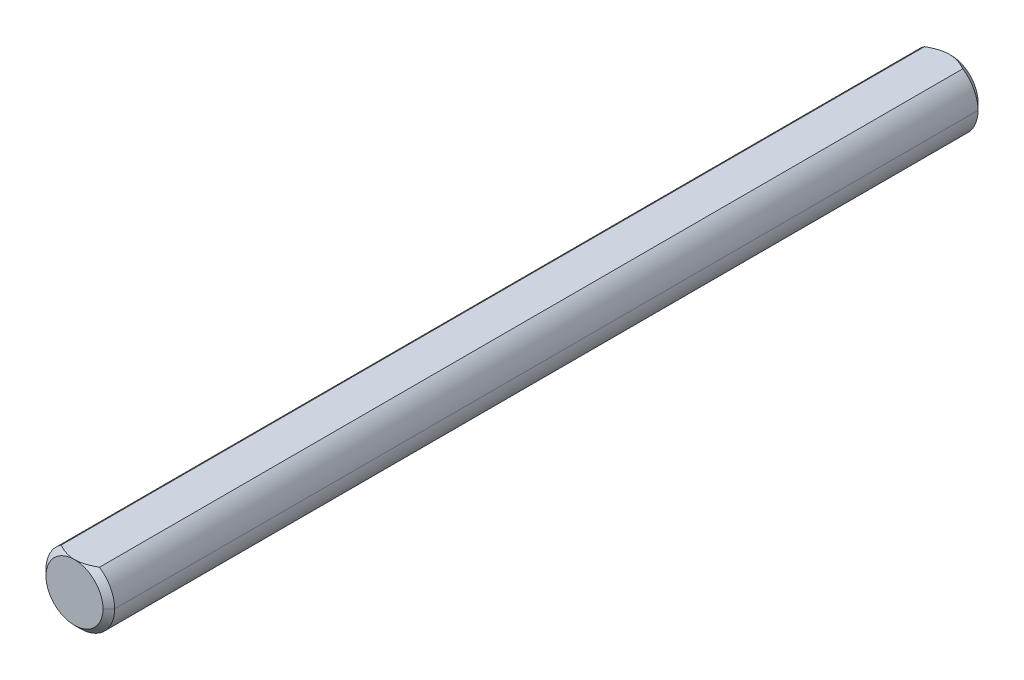
ISO-10303-21;
HEADER;
FILE_DESCRIPTION(('STEP AP214'),'2;1');
FILE_NAME('part.step','',(''),(''),'','','');
FILE_SCHEMA(('AUTOMOTIVE_DESIGN { 1 0 10303 214 1 1 1 1 }'));
ENDSEC;
DATA;
#1=APPLICATION_CONTEXT('core data for automotive mechanical design processes');
#2=APPLICATION_PROTOCOL_DEFINITION('international standard','automotive_design',2000,#1);
#3=PRODUCT_CONTEXT('',#1,'mechanical');
#4=PRODUCT('Part','Part','',(#3));
#5=PRODUCT_RELATED_PRODUCT_CATEGORY('part','',(#4));
#6=PRODUCT_DEFINITION_FORMATION('','',#4);
#7=PRODUCT_DEFINITION_CONTEXT('part definition',#1,'design');
#8=PRODUCT_DEFINITION('design','',#6,#7);
#9=PRODUCT_DEFINITION_SHAPE('','',#8);
#10=(LENGTH_UNIT() NAMED_UNIT(*) SI_UNIT(.MILLI.,.METRE.));
#11=(NAMED_UNIT(*) PLANE_ANGLE_UNIT() SI_UNIT($,.RADIAN.));
#12=(NAMED_UNIT(*) SI_UNIT($,.STERADIAN.) SOLID_ANGLE_UNIT());
#13=UNCERTAINTY_MEASURE_WITH_UNIT(LENGTH_MEASURE(1.E-05),#10,'distance_accuracy_value','');
#14=(GEOMETRIC_REPRESENTATION_CONTEXT(3) GLOBAL_UNCERTAINTY_ASSIGNED_CONTEXT((#13)) GLOBAL_UNIT_ASSIGNED_CONTEXT((#10,
#11,#12)) REPRESENTATION_CONTEXT('',''));
#15=CARTESIAN_POINT('',(0.,0.,0.));
#16=DIRECTION('',(0.,0.,1.));
#17=DIRECTION('',(1.,0.,0.));
#18=AXIS2_PLACEMENT_3D('',#15,#16,#17);
#19=CARTESIAN_POINT('',(0.,0.,0.500000000000014));
#20=DIRECTION('',(0.,0.,1.));
#21=DIRECTION('',(1.,0.,0.));
#22=AXIS2_PLACEMENT_3D('',#19,#20,#21);
#23=CONICAL_SURFACE('',#22,2.35,0.785398163397443);
#24=CARTESIAN_POINT('',(0.,0.,0.));
#25=DIRECTION('',(0.,0.,-1.));
#26=DIRECTION('',(1.,0.,0.));
#27=AXIS2_PLACEMENT_3D('',#24,#25,#26);
#28=CIRCLE('',#27,1.85);
#29=CARTESIAN_POINT('',(-1.85,0.,0.));
#30=VERTEX_POINT('',#29);
#31=CARTESIAN_POINT('',(1.85,0.,0.));
#32=VERTEX_POINT('',#31);
#33=EDGE_CURVE('E132',#30,#32,#28,.T.);
#34=ORIENTED_EDGE('',*,*,#33,.F.);
#35=DIRECTION('',(-0.707106781186544,0.,0.707106781186551));
#36=VECTOR('',#35,1.);
#37=CARTESIAN_POINT('',(-2.35,0.,0.500000000000014));
#38=LINE('',#37,#36);
#39=CARTESIAN_POINT('',(-2.35,0.,0.500000000000014));
#40=VERTEX_POINT('',#39);
#41=EDGE_CURVE('E130',#30,#40,#38,.T.);
#42=ORIENTED_EDGE('',*,*,#41,.T.);
#43=CARTESIAN_POINT('',(0.,0.,0.500000000000014));
#44=DIRECTION('',(0.,0.,1.));
#45=DIRECTION('',(1.,0.,0.));
#46=AXIS2_PLACEMENT_3D('',#43,#44,#45);
#47=CIRCLE('',#46,2.35);
#48=CARTESIAN_POINT('',(-1.3114877048604,1.95,0.500000000000014));
#49=VERTEX_POINT('',#48);
#50=EDGE_CURVE('E118',#49,#40,#47,.T.);
#51=ORIENTED_EDGE('',*,*,#50,.F.);
#52=CARTESIAN_POINT('',(1.3114877048604,1.95,0.5));
#53=CARTESIAN_POINT('',(0.97667509388741,1.95,0.313147820117807));
#54=CARTESIAN_POINT('',(0.681837072694635,1.95,0.215769056235701));
#55=CARTESIAN_POINT('',(0.331962584751925,1.95,0.100212911163508));
#56=CARTESIAN_POINT('',(0.000682154319043768,1.95,0.100000119316504));
#57=CARTESIAN_POINT('',(-0.329647314696258,1.95,0.0997879383020095));
#58=CARTESIAN_POINT('',(-0.680601643968959,1.95,0.215361614287701));
#59=CARTESIAN_POINT('',(-0.975427127590812,1.95,0.312451355243604));
#60=CARTESIAN_POINT('',(-1.3114877048604,1.95,0.5));
#61=B_SPLINE_CURVE_WITH_KNOTS('',2,(#52,#53,#54,#55,#56,#57,#58,#59,#60),.UNSPECIFIED.,.F.,.F.,
(3,2,2,2,3),(0.,0.25,0.5,0.75,1.),.UNSPECIFIED.);
#62=CARTESIAN_POINT('',(1.3114877048604,1.95,0.500000000000014));
#63=VERTEX_POINT('',#62);
#64=EDGE_CURVE('E154',#63,#49,#61,.T.);
#65=ORIENTED_EDGE('',*,*,#64,.F.);
#66=CARTESIAN_POINT('',(0.,0.,0.500000000000014));
#67=DIRECTION('',(0.,0.,1.));
#68=DIRECTION('',(1.,0.,0.));
#69=AXIS2_PLACEMENT_3D('',#66,#67,#68);
#70=CIRCLE('',#69,2.35);
#71=CARTESIAN_POINT('',(2.35,0.,0.500000000000014));
#72=VERTEX_POINT('',#71);
#73=EDGE_CURVE('E115',#72,#63,#70,.T.);
#74=ORIENTED_EDGE('',*,*,#73,.F.);
#75=DIRECTION('',(0.707106781186544,0.,0.707106781186551));
#76=VECTOR('',#75,1.);
#77=CARTESIAN_POINT('',(2.35,0.,0.500000000000014));
#78=LINE('',#77,#76);
#79=EDGE_CURVE('E142',#32,#72,#78,.T.);
#80=ORIENTED_EDGE('',*,*,#79,.F.);
#81=EDGE_LOOP('',(#34,#42,#51,#65,#74,#80));
#82=FACE_BOUND('',#81,.T.);
#83=ADVANCED_FACE('F44',(#82),#23,.T.);
#84=CARTESIAN_POINT('',(0.,0.,100.));
#85=DIRECTION('',(0.,0.,-1.));
#86=DIRECTION('',(-1.,0.,0.));
#87=AXIS2_PLACEMENT_3D('',#84,#85,#86);
#88=CYLINDRICAL_SURFACE('',#87,2.35);
#89=DIRECTION('',(0.,0.,-1.));
#90=VECTOR('',#89,1.);
#91=CARTESIAN_POINT('',(1.3114877048604,1.95,100.));
#92=LINE('',#91,#90);
#93=CARTESIAN_POINT('',(1.3114877048604,1.95,59.6));
#94=VERTEX_POINT('',#93);
#95=EDGE_CURVE('E127',#94,#63,#92,.T.);
#96=ORIENTED_EDGE('',*,*,#95,.F.);
#97=CARTESIAN_POINT('',(0.,0.,59.6));
#98=DIRECTION('',(0.,0.,-1.));
#99=DIRECTION('',(-1.,0.,0.));
#100=AXIS2_PLACEMENT_3D('',#97,#98,#99);
#101=CIRCLE('',#100,2.35);
#102=CARTESIAN_POINT('',(2.35,0.,59.6));
#103=VERTEX_POINT('',#102);
#104=EDGE_CURVE('E69',#94,#103,#101,.T.);
#105=ORIENTED_EDGE('',*,*,#104,.T.);
#106=DIRECTION('',(0.,0.,-1.));
#107=VECTOR('',#106,1.);
#108=CARTESIAN_POINT('',(2.35,0.,100.));
#109=LINE('',#108,#107);
#110=EDGE_CURVE('E138',#103,#72,#109,.T.);
#111=ORIENTED_EDGE('',*,*,#110,.T.);
#112=ORIENTED_EDGE('',*,*,#73,.T.);
#113=EDGE_LOOP('',(#96,#105,#111,#112));
#114=FACE_BOUND('',#113,.T.);
#115=ADVANCED_FACE('F175',(#114),#88,.T.);
#116=CARTESIAN_POINT('',(0.,0.,100.));
#117=DIRECTION('',(0.,0.,-1.));
#118=DIRECTION('',(-1.,0.,0.));
#119=AXIS2_PLACEMENT_3D('',#116,#117,#118);
#120=CYLINDRICAL_SURFACE('',#119,2.35);
#121=ORIENTED_EDGE('',*,*,#110,.F.);
#122=CARTESIAN_POINT('',(0.,0.,59.6));
#123=DIRECTION('',(0.,0.,-1.));
#124=DIRECTION('',(-1.,0.,0.));
#125=AXIS2_PLACEMENT_3D('',#122,#123,#124);
#126=CIRCLE('',#125,2.35);
#127=CARTESIAN_POINT('',(-2.35,0.,59.6));
#128=VERTEX_POINT('',#127);
#129=EDGE_CURVE('E54',#103,#128,#126,.T.);
#130=ORIENTED_EDGE('',*,*,#129,.T.);
#131=DIRECTION('',(0.,0.,-1.));
#132=VECTOR('',#131,1.);
#133=CARTESIAN_POINT('',(-2.35,0.,100.));
#134=LINE('',#133,#132);
#135=EDGE_CURVE('E108',#128,#40,#134,.T.);
#136=ORIENTED_EDGE('',*,*,#135,.T.);
#137=CARTESIAN_POINT('',(0.,0.,0.500000000000014));
#138=DIRECTION('',(0.,0.,1.));
#139=DIRECTION('',(1.,0.,0.));
#140=AXIS2_PLACEMENT_3D('',#137,#138,#139);
#141=CIRCLE('',#140,2.35);
#142=EDGE_CURVE('E112',#40,#72,#141,.T.);
#143=ORIENTED_EDGE('',*,*,#142,.T.);
#144=EDGE_LOOP('',(#121,#130,#136,#143));
#145=FACE_BOUND('',#144,.T.);
#146=ADVANCED_FACE('F110',(#145),#120,.T.);
#147=CARTESIAN_POINT('',(0.,0.,100.));
#148=DIRECTION('',(0.,0.,-1.));
#149=DIRECTION('',(-1.,0.,0.));
#150=AXIS2_PLACEMENT_3D('',#147,#148,#149);
#151=CYLINDRICAL_SURFACE('',#150,2.35);
#152=ORIENTED_EDGE('',*,*,#135,.F.);
#153=CARTESIAN_POINT('',(0.,0.,59.6));
#154=DIRECTION('',(0.,0.,-1.));
#155=DIRECTION('',(-1.,0.,0.));
#156=AXIS2_PLACEMENT_3D('',#153,#154,#155);
#157=CIRCLE('',#156,2.35);
#158=CARTESIAN_POINT('',(-1.3114877048604,1.95,59.6));
#159=VERTEX_POINT('',#158);
#160=EDGE_CURVE('E11',#128,#159,#157,.T.);
#161=ORIENTED_EDGE('',*,*,#160,.T.);
#162=DIRECTION('',(0.,0.,-1.));
#163=VECTOR('',#162,1.);
#164=CARTESIAN_POINT('',(-1.3114877048604,1.95,100.));
#165=LINE('',#164,#163);
#166=EDGE_CURVE('E122',#159,#49,#165,.T.);
#167=ORIENTED_EDGE('',*,*,#166,.T.);
#168=ORIENTED_EDGE('',*,*,#50,.T.);
#169=EDGE_LOOP('',(#152,#161,#167,#168));
#170=FACE_BOUND('',#169,.T.);
#171=ADVANCED_FACE('F120',(#170),#151,.T.);
#172=CARTESIAN_POINT('',(-1.3114877048604,1.95,100.));
#173=DIRECTION('',(0.,-1.,0.));
#174=DIRECTION('',(0.,0.,-1.));
#175=AXIS2_PLACEMENT_3D('',#172,#173,#174);
#176=PLANE('',#175);
#177=CARTESIAN_POINT('',(-1.3114877048604,1.95,59.6));
#178=CARTESIAN_POINT('',(-1.27600690128936,1.95,59.6197988217917));
#179=CARTESIAN_POINT('',(-1.24029308806387,1.95,59.6391792212025));
#180=CARTESIAN_POINT('',(-1.16837111388397,1.95,59.6769726968463));
#181=CARTESIAN_POINT('',(-1.13216309931684,1.95,59.6953860520157));
#182=CARTESIAN_POINT('',(-1.02239849375708,1.95,59.7491564313072));
#183=CARTESIAN_POINT('',(-0.948017360065307,1.95,59.7828647569389));
#184=CARTESIAN_POINT('',(-0.798932819408021,1.95,59.8437488542966));
#185=CARTESIAN_POINT('',(-0.724292074311774,1.95,59.871076145163));
#186=CARTESIAN_POINT('',(-0.572856109049338,1.95,59.9188638316248));
#187=CARTESIAN_POINT('',(-0.49606245396364,1.95,59.9393290822243));
#188=CARTESIAN_POINT('',(-0.350010884745252,1.95,59.969962402717));
#189=CARTESIAN_POINT('',(-0.280955040323251,1.95,59.9810716965353));
#190=CARTESIAN_POINT('',(-0.176406784430094,1.95,59.9923491917868));
#191=CARTESIAN_POINT('',(-0.141192555342848,1.95,59.9952112184071));
#192=CARTESIAN_POINT('',(-0.070654536255775,1.95,59.999039277512));
#193=CARTESIAN_POINT('',(-0.0353307259057692,1.95,60.0000049337303));
#194=CARTESIAN_POINT('',(0.,1.95,60.));
#195=B_SPLINE_CURVE_WITH_KNOTS('',3,(#177,#178,#179,#180,#181,#182,#183,#184,#185,#186,#187,
#188,#189,#190,#191,#192,#193,#194),.UNSPECIFIED.,.F.,.F.,(4,2,2,2,2,2,2,2,4),(0.,
0.121887557509282,0.243739762207238,0.488532241513252,0.72673019754761,0.96475926731283,
1.17421327337038,1.28015830544421,1.38612435636559),.UNSPECIFIED.);
#196=CARTESIAN_POINT('',(0.,1.95,60.));
#197=VERTEX_POINT('',#196);
#198=EDGE_CURVE('E182',#159,#197,#195,.T.);
#199=ORIENTED_EDGE('',*,*,#198,.T.);
#200=CARTESIAN_POINT('',(0.,1.94999999999999,60.));
#201=CARTESIAN_POINT('',(0.0599401606188808,1.95,60.0000501722459));
#202=CARTESIAN_POINT('',(0.119849825960097,1.95,59.9972374285214));
#203=CARTESIAN_POINT('',(0.239070182034729,1.95,59.9862815796125));
#204=CARTESIAN_POINT('',(0.29838179398534,1.95,59.9781486042062));
#205=CARTESIAN_POINT('',(0.415152467232797,1.95,59.957115482853));
#206=CARTESIAN_POINT('',(0.472625981594059,1.95,59.9442940922673));
#207=CARTESIAN_POINT('',(0.586484260676487,1.95,59.9144543064569));
#208=CARTESIAN_POINT('',(0.642868586240938,1.95,59.8974342549237));
#209=CARTESIAN_POINT('',(0.751460020489586,1.95,59.860809494995));
#210=CARTESIAN_POINT('',(0.803730167020583,1.95,59.8413895121685));
#211=CARTESIAN_POINT('',(0.907176021484579,1.95,59.7998313218281));
#212=CARTESIAN_POINT('',(0.95835164002734,1.95,59.7776928932864));
#213=CARTESIAN_POINT('',(1.06046799976331,1.95,59.730766137494));
#214=CARTESIAN_POINT('',(1.1113915815028,1.95,59.7059407696961));
#215=CARTESIAN_POINT('',(1.21219252034972,1.95,59.6543408413078));
#216=CARTESIAN_POINT('',(1.26207068561652,1.95,59.6275678637354));
#217=CARTESIAN_POINT('',(1.3114877048604,1.95,59.6));
#218=B_SPLINE_CURVE_WITH_KNOTS('',3,(#200,#201,#202,#203,#204,#205,#206,#207,#208,#209,#210,
#211,#212,#213,#214,#215,#216,#217),.UNSPECIFIED.,.F.,.F.,(4,2,2,2,2,2,2,2,4),(0.,
0.179705916689168,0.359070663416353,0.535551355394372,0.712101777987906,0.879297867205953,
1.04650755960598,1.21641932063546,1.38619448801061),.UNSPECIFIED.);
#219=EDGE_CURVE('E189',#197,#94,#218,.T.);
#220=ORIENTED_EDGE('',*,*,#219,.T.);
#221=ORIENTED_EDGE('',*,*,#95,.T.);
#222=ORIENTED_EDGE('',*,*,#64,.T.);
#223=ORIENTED_EDGE('',*,*,#166,.F.);
#224=EDGE_LOOP('',(#199,#220,#221,#222,#223));
#225=FACE_BOUND('',#224,.T.);
#226=ADVANCED_FACE('F164',(#225),#176,.F.);
#227=CARTESIAN_POINT('',(0.,0.,0.));
#228=DIRECTION('',(0.,0.,1.));
#229=DIRECTION('',(1.,0.,0.));
#230=AXIS2_PLACEMENT_3D('',#227,#228,#229);
#231=PLANE('',#230);
#232=CARTESIAN_POINT('',(0.,0.,0.));
#233=DIRECTION('',(0.,0.,-1.));
#234=DIRECTION('',(1.,0.,0.));
#235=AXIS2_PLACEMENT_3D('',#232,#233,#234);
#236=CIRCLE('',#235,1.85);
#237=EDGE_CURVE('E151',#32,#30,#236,.T.);
#238=ORIENTED_EDGE('',*,*,#237,.T.);
#239=ORIENTED_EDGE('',*,*,#33,.T.);
#240=EDGE_LOOP('',(#238,#239));
#241=FACE_BOUND('',#240,.T.);
#242=ADVANCED_FACE('F174',(#241),#231,.F.);
#243=CARTESIAN_POINT('',(0.,0.,0.500000000000014));
#244=DIRECTION('',(0.,0.,1.));
#245=DIRECTION('',(1.,0.,0.));
#246=AXIS2_PLACEMENT_3D('',#243,#244,#245);
#247=CONICAL_SURFACE('',#246,2.35,0.785398163397443);
#248=ORIENTED_EDGE('',*,*,#41,.F.);
#249=ORIENTED_EDGE('',*,*,#237,.F.);
#250=ORIENTED_EDGE('',*,*,#79,.T.);
#251=ORIENTED_EDGE('',*,*,#142,.F.);
#252=EDGE_LOOP('',(#248,#249,#250,#251));
#253=FACE_BOUND('',#252,.T.);
#254=ADVANCED_FACE('F141',(#253),#247,.T.);
#255=CARTESIAN_POINT('',(22.9229281632683,-2.35,60.));
#256=DIRECTION('',(0.,0.,-1.));
#257=DIRECTION('',(-1.,0.,0.));
#258=AXIS2_PLACEMENT_3D('',#255,#256,#257);
#259=PLANE('',#258);
#260=CARTESIAN_POINT('',(0.,0.,60.));
#261=DIRECTION('',(0.,0.,-1.));
#262=DIRECTION('',(-1.,0.,0.));
#263=AXIS2_PLACEMENT_3D('',#260,#261,#262);
#264=CIRCLE('',#263,1.94999999999999);
#265=CARTESIAN_POINT('',(-1.94999999999999,0.,60.));
#266=VERTEX_POINT('',#265);
#267=CARTESIAN_POINT('',(1.94999999999999,0.,60.));
#268=VERTEX_POINT('',#267);
#269=EDGE_CURVE('E241',#266,#268,#264,.F.);
#270=ORIENTED_EDGE('',*,*,#269,.T.);
#271=CARTESIAN_POINT('',(0.,0.,60.));
#272=DIRECTION('',(0.,0.,-1.));
#273=DIRECTION('',(-1.,0.,0.));
#274=AXIS2_PLACEMENT_3D('',#271,#272,#273);
#275=CIRCLE('',#274,1.94999999999999);
#276=EDGE_CURVE('E190',#268,#197,#275,.F.);
#277=ORIENTED_EDGE('',*,*,#276,.T.);
#278=CARTESIAN_POINT('',(0.,0.,60.));
#279=DIRECTION('',(0.,0.,-1.));
#280=DIRECTION('',(-1.,0.,0.));
#281=AXIS2_PLACEMENT_3D('',#278,#279,#280);
#282=CIRCLE('',#281,1.94999999999999);
#283=EDGE_CURVE('E137',#197,#266,#282,.F.);
#284=ORIENTED_EDGE('',*,*,#283,.T.);
#285=EDGE_LOOP('',(#270,#277,#284));
#286=FACE_BOUND('',#285,.T.);
#287=ADVANCED_FACE('F211',(#286),#259,.F.);
#288=CARTESIAN_POINT('',(0.,0.,60.));
#289=DIRECTION('',(0.,0.,-1.));
#290=DIRECTION('',(-1.,0.,0.));
#291=AXIS2_PLACEMENT_3D('',#288,#289,#290);
#292=CONICAL_SURFACE('',#291,1.94999999999999,0.785398163397446);
#293=ORIENTED_EDGE('',*,*,#198,.F.);
#294=ORIENTED_EDGE('',*,*,#160,.F.);
#295=DIRECTION('',(-0.707106781186549,0.,-0.707106781186546));
#296=VECTOR('',#295,1.);
#297=CARTESIAN_POINT('',(-1.94999999999999,0.,60.));
#298=LINE('',#297,#296);
#299=EDGE_CURVE('E49',#266,#128,#298,.T.);
#300=ORIENTED_EDGE('',*,*,#299,.F.);
#301=ORIENTED_EDGE('',*,*,#283,.F.);
#302=EDGE_LOOP('',(#293,#294,#300,#301));
#303=FACE_BOUND('',#302,.T.);
#304=ADVANCED_FACE('F46',(#303),#292,.T.);
#305=CARTESIAN_POINT('',(0.,0.,60.));
#306=DIRECTION('',(0.,0.,-1.));
#307=DIRECTION('',(-1.,0.,0.));
#308=AXIS2_PLACEMENT_3D('',#305,#306,#307);
#309=CONICAL_SURFACE('',#308,1.94999999999999,0.785398163397446);
#310=ORIENTED_EDGE('',*,*,#299,.T.);
#311=ORIENTED_EDGE('',*,*,#129,.F.);
#312=DIRECTION('',(0.707106781186548,0.,-0.707106781186547));
#313=VECTOR('',#312,1.);
#314=CARTESIAN_POINT('',(1.94999999999999,0.,60.));
#315=LINE('',#314,#313);
#316=EDGE_CURVE('E249',#268,#103,#315,.T.);
#317=ORIENTED_EDGE('',*,*,#316,.F.);
#318=ORIENTED_EDGE('',*,*,#269,.F.);
#319=EDGE_LOOP('',(#310,#311,#317,#318));
#320=FACE_BOUND('',#319,.T.);
#321=ADVANCED_FACE('F203',(#320),#309,.T.);
#322=CARTESIAN_POINT('',(0.,0.,60.));
#323=DIRECTION('',(0.,0.,-1.));
#324=DIRECTION('',(-1.,0.,0.));
#325=AXIS2_PLACEMENT_3D('',#322,#323,#324);
#326=CONICAL_SURFACE('',#325,1.94999999999999,0.785398163397446);
#327=ORIENTED_EDGE('',*,*,#316,.T.);
#328=ORIENTED_EDGE('',*,*,#104,.F.);
#329=ORIENTED_EDGE('',*,*,#219,.F.);
#330=ORIENTED_EDGE('',*,*,#276,.F.);
#331=EDGE_LOOP('',(#327,#328,#329,#330));
#332=FACE_BOUND('',#331,.T.);
#333=ADVANCED_FACE('F199',(#332),#326,.T.);
#334=CLOSED_SHELL('',(#83,#115,#146,#171,#226,#242,#254,#287,#304,#321,#333));
#335=MANIFOLD_SOLID_BREP('B2',#334);
#336=ADVANCED_BREP_SHAPE_REPRESENTATION('',(#18,#335),#14);
#337=SHAPE_DEFINITION_REPRESENTATION(#9,#336);
ENDSEC;
END-ISO-10303-21;
